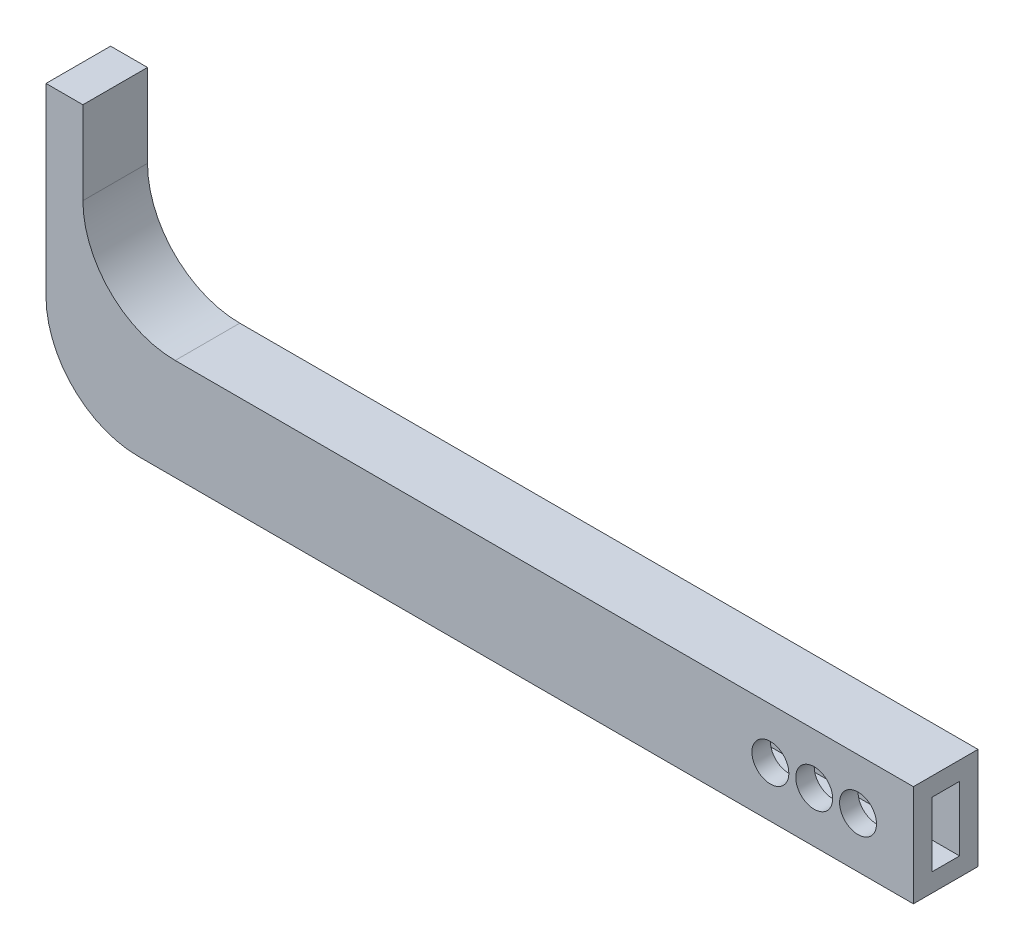
ISO-10303-21;
HEADER;
FILE_DESCRIPTION(('STEP AP214'),'2;1');
FILE_NAME('part.step','',(''),(''),'','','');
FILE_SCHEMA(('AUTOMOTIVE_DESIGN { 1 0 10303 214 1 1 1 1 }'));
ENDSEC;
DATA;
#1=APPLICATION_CONTEXT('core data for automotive mechanical design processes');
#2=APPLICATION_PROTOCOL_DEFINITION('international standard','automotive_design',2000,#1);
#3=PRODUCT_CONTEXT('',#1,'mechanical');
#4=PRODUCT('Part','Part','',(#3));
#5=PRODUCT_RELATED_PRODUCT_CATEGORY('part','',(#4));
#6=PRODUCT_DEFINITION_FORMATION('','',#4);
#7=PRODUCT_DEFINITION_CONTEXT('part definition',#1,'design');
#8=PRODUCT_DEFINITION('design','',#6,#7);
#9=PRODUCT_DEFINITION_SHAPE('','',#8);
#10=(LENGTH_UNIT() NAMED_UNIT(*) SI_UNIT(.MILLI.,.METRE.));
#11=(NAMED_UNIT(*) PLANE_ANGLE_UNIT() SI_UNIT($,.RADIAN.));
#12=(NAMED_UNIT(*) SI_UNIT($,.STERADIAN.) SOLID_ANGLE_UNIT());
#13=UNCERTAINTY_MEASURE_WITH_UNIT(LENGTH_MEASURE(1.E-05),#10,'distance_accuracy_value','');
#14=(GEOMETRIC_REPRESENTATION_CONTEXT(3) GLOBAL_UNCERTAINTY_ASSIGNED_CONTEXT((#13)) GLOBAL_UNIT_ASSIGNED_CONTEXT((#10,
#11,#12)) REPRESENTATION_CONTEXT('',''));
#15=CARTESIAN_POINT('',(0.,0.,0.));
#16=DIRECTION('',(0.,0.,1.));
#17=DIRECTION('',(1.,0.,0.));
#18=AXIS2_PLACEMENT_3D('',#15,#16,#17);
#19=CARTESIAN_POINT('',(0.,5.5,3.5));
#20=DIRECTION('',(-1.,0.,0.));
#21=DIRECTION('',(0.,-1.,0.));
#22=AXIS2_PLACEMENT_3D('',#19,#20,#21);
#23=PLANE('',#22);
#24=DIRECTION('',(0.,1.,0.));
#25=VECTOR('',#24,1.);
#26=CARTESIAN_POINT('',(0.,5.5,0.));
#27=LINE('',#26,#25);
#28=CARTESIAN_POINT('',(0.,0.,0.));
#29=VERTEX_POINT('',#28);
#30=CARTESIAN_POINT('',(0.,5.5,0.));
#31=VERTEX_POINT('',#30);
#32=EDGE_CURVE('E160',#29,#31,#27,.T.);
#33=ORIENTED_EDGE('',*,*,#32,.T.);
#34=DIRECTION('',(0.,0.,-1.));
#35=VECTOR('',#34,1.);
#36=CARTESIAN_POINT('',(0.,5.5,3.5));
#37=LINE('',#36,#35);
#38=CARTESIAN_POINT('',(0.,5.5,3.5));
#39=VERTEX_POINT('',#38);
#40=EDGE_CURVE('E227',#39,#31,#37,.T.);
#41=ORIENTED_EDGE('',*,*,#40,.F.);
#42=DIRECTION('',(0.,1.,0.));
#43=VECTOR('',#42,1.);
#44=CARTESIAN_POINT('',(0.,5.5,3.5));
#45=LINE('',#44,#43);
#46=CARTESIAN_POINT('',(0.,0.,3.5));
#47=VERTEX_POINT('',#46);
#48=EDGE_CURVE('E194',#47,#39,#45,.T.);
#49=ORIENTED_EDGE('',*,*,#48,.F.);
#50=DIRECTION('',(0.,0.,-1.));
#51=VECTOR('',#50,1.);
#52=CARTESIAN_POINT('',(0.,0.,3.5));
#53=LINE('',#52,#51);
#54=EDGE_CURVE('E208',#47,#29,#53,.T.);
#55=ORIENTED_EDGE('',*,*,#54,.T.);
#56=EDGE_LOOP('',(#33,#41,#49,#55));
#57=FACE_BOUND('',#56,.T.);
#58=DIRECTION('',(0.,1.,0.));
#59=VECTOR('',#58,1.);
#60=CARTESIAN_POINT('',(0.,0.,1.));
#61=LINE('',#60,#59);
#62=CARTESIAN_POINT('',(0.,1.,1.));
#63=VERTEX_POINT('',#62);
#64=CARTESIAN_POINT('',(0.,4.5,1.));
#65=VERTEX_POINT('',#64);
#66=EDGE_CURVE('E190',#63,#65,#61,.T.);
#67=ORIENTED_EDGE('',*,*,#66,.F.);
#68=DIRECTION('',(0.,0.,-1.));
#69=VECTOR('',#68,1.);
#70=CARTESIAN_POINT('',(0.,1.,3.5));
#71=LINE('',#70,#69);
#72=CARTESIAN_POINT('',(0.,1.,2.5));
#73=VERTEX_POINT('',#72);
#74=EDGE_CURVE('E186',#73,#63,#71,.T.);
#75=ORIENTED_EDGE('',*,*,#74,.F.);
#76=DIRECTION('',(0.,1.,0.));
#77=VECTOR('',#76,1.);
#78=CARTESIAN_POINT('',(0.,0.,2.5));
#79=LINE('',#78,#77);
#80=CARTESIAN_POINT('',(0.,4.5,2.5));
#81=VERTEX_POINT('',#80);
#82=EDGE_CURVE('E50',#73,#81,#79,.T.);
#83=ORIENTED_EDGE('',*,*,#82,.T.);
#84=DIRECTION('',(0.,0.,-1.));
#85=VECTOR('',#84,1.);
#86=CARTESIAN_POINT('',(0.,4.5,3.5));
#87=LINE('',#86,#85);
#88=EDGE_CURVE('E154',#81,#65,#87,.T.);
#89=ORIENTED_EDGE('',*,*,#88,.T.);
#90=EDGE_LOOP('',(#67,#75,#83,#89));
#91=FACE_BOUND('',#90,.T.);
#92=ADVANCED_FACE('F33',(#57,#91),#23,.F.);
#93=CARTESIAN_POINT('',(-45.,5.5,3.5));
#94=DIRECTION('',(0.,-1.,0.));
#95=DIRECTION('',(0.,0.,-1.));
#96=AXIS2_PLACEMENT_3D('',#93,#94,#95);
#97=PLANE('',#96);
#98=DIRECTION('',(-1.,0.,0.));
#99=VECTOR('',#98,1.);
#100=CARTESIAN_POINT('',(-45.,5.5,0.));
#101=LINE('',#100,#99);
#102=CARTESIAN_POINT('',(-40.,5.5,0.));
#103=VERTEX_POINT('',#102);
#104=EDGE_CURVE('E163',#31,#103,#101,.T.);
#105=ORIENTED_EDGE('',*,*,#104,.T.);
#106=DIRECTION('',(0.,0.,-1.));
#107=VECTOR('',#106,1.);
#108=CARTESIAN_POINT('',(-40.,5.5,3.5));
#109=LINE('',#108,#107);
#110=CARTESIAN_POINT('',(-40.,5.5,3.5));
#111=VERTEX_POINT('',#110);
#112=EDGE_CURVE('E233',#103,#111,#109,.F.);
#113=ORIENTED_EDGE('',*,*,#112,.T.);
#114=DIRECTION('',(-1.,0.,0.));
#115=VECTOR('',#114,1.);
#116=CARTESIAN_POINT('',(-45.,5.5,3.5));
#117=LINE('',#116,#115);
#118=EDGE_CURVE('E197',#39,#111,#117,.T.);
#119=ORIENTED_EDGE('',*,*,#118,.F.);
#120=ORIENTED_EDGE('',*,*,#40,.T.);
#121=EDGE_LOOP('',(#105,#113,#119,#120));
#122=FACE_BOUND('',#121,.T.);
#123=ADVANCED_FACE('F296',(#122),#97,.F.);
#124=CARTESIAN_POINT('',(-45.,15.,3.5));
#125=DIRECTION('',(-1.,0.,0.));
#126=DIRECTION('',(0.,0.,1.));
#127=AXIS2_PLACEMENT_3D('',#124,#125,#126);
#128=PLANE('',#127);
#129=DIRECTION('',(0.,1.,0.));
#130=VECTOR('',#129,1.);
#131=CARTESIAN_POINT('',(-45.,15.,3.5));
#132=LINE('',#131,#130);
#133=CARTESIAN_POINT('',(-45.,10.5,3.5));
#134=VERTEX_POINT('',#133);
#135=CARTESIAN_POINT('',(-45.,15.,3.5));
#136=VERTEX_POINT('',#135);
#137=EDGE_CURVE('E201',#134,#136,#132,.T.);
#138=ORIENTED_EDGE('',*,*,#137,.F.);
#139=DIRECTION('',(0.,0.,-1.));
#140=VECTOR('',#139,1.);
#141=CARTESIAN_POINT('',(-45.,10.5,0.));
#142=LINE('',#141,#140);
#143=CARTESIAN_POINT('',(-45.,10.5,0.));
#144=VERTEX_POINT('',#143);
#145=EDGE_CURVE('E230',#134,#144,#142,.T.);
#146=ORIENTED_EDGE('',*,*,#145,.T.);
#147=DIRECTION('',(0.,1.,0.));
#148=VECTOR('',#147,1.);
#149=CARTESIAN_POINT('',(-45.,15.,0.));
#150=LINE('',#149,#148);
#151=CARTESIAN_POINT('',(-45.,15.,0.));
#152=VERTEX_POINT('',#151);
#153=EDGE_CURVE('E212',#144,#152,#150,.T.);
#154=ORIENTED_EDGE('',*,*,#153,.T.);
#155=DIRECTION('',(0.,0.,-1.));
#156=VECTOR('',#155,1.);
#157=CARTESIAN_POINT('',(-45.,15.,3.5));
#158=LINE('',#157,#156);
#159=EDGE_CURVE('E224',#136,#152,#158,.T.);
#160=ORIENTED_EDGE('',*,*,#159,.F.);
#161=EDGE_LOOP('',(#138,#146,#154,#160));
#162=FACE_BOUND('',#161,.T.);
#163=ADVANCED_FACE('F302',(#162),#128,.F.);
#164=CARTESIAN_POINT('',(-47.,15.,3.5));
#165=DIRECTION('',(0.,-1.,0.));
#166=DIRECTION('',(0.,0.,-1.));
#167=AXIS2_PLACEMENT_3D('',#164,#165,#166);
#168=PLANE('',#167);
#169=DIRECTION('',(-1.,0.,0.));
#170=VECTOR('',#169,1.);
#171=CARTESIAN_POINT('',(-47.,15.,0.));
#172=LINE('',#171,#170);
#173=CARTESIAN_POINT('',(-47.,15.,0.));
#174=VERTEX_POINT('',#173);
#175=EDGE_CURVE('E214',#152,#174,#172,.T.);
#176=ORIENTED_EDGE('',*,*,#175,.T.);
#177=DIRECTION('',(0.,0.,-1.));
#178=VECTOR('',#177,1.);
#179=CARTESIAN_POINT('',(-47.,15.,3.5));
#180=LINE('',#179,#178);
#181=CARTESIAN_POINT('',(-47.,15.,3.5));
#182=VERTEX_POINT('',#181);
#183=EDGE_CURVE('E221',#182,#174,#180,.T.);
#184=ORIENTED_EDGE('',*,*,#183,.F.);
#185=DIRECTION('',(-1.,0.,0.));
#186=VECTOR('',#185,1.);
#187=CARTESIAN_POINT('',(-47.,15.,3.5));
#188=LINE('',#187,#186);
#189=EDGE_CURVE('E203',#136,#182,#188,.T.);
#190=ORIENTED_EDGE('',*,*,#189,.F.);
#191=ORIENTED_EDGE('',*,*,#159,.T.);
#192=EDGE_LOOP('',(#176,#184,#190,#191));
#193=FACE_BOUND('',#192,.T.);
#194=ADVANCED_FACE('F331',(#193),#168,.F.);
#195=CARTESIAN_POINT('',(-47.,0.,3.5));
#196=DIRECTION('',(1.,0.,0.));
#197=DIRECTION('',(0.,0.,-1.));
#198=AXIS2_PLACEMENT_3D('',#195,#196,#197);
#199=PLANE('',#198);
#200=DIRECTION('',(0.,-1.,0.));
#201=VECTOR('',#200,1.);
#202=CARTESIAN_POINT('',(-47.,0.,0.));
#203=LINE('',#202,#201);
#204=CARTESIAN_POINT('',(-47.,4.99999999999999,0.));
#205=VERTEX_POINT('',#204);
#206=EDGE_CURVE('E216',#174,#205,#203,.T.);
#207=ORIENTED_EDGE('',*,*,#206,.T.);
#208=DIRECTION('',(0.,0.,-1.));
#209=VECTOR('',#208,1.);
#210=CARTESIAN_POINT('',(-47.,4.99999999999999,3.5));
#211=LINE('',#210,#209);
#212=CARTESIAN_POINT('',(-47.,4.99999999999999,3.5));
#213=VERTEX_POINT('',#212);
#214=EDGE_CURVE('E58',#205,#213,#211,.F.);
#215=ORIENTED_EDGE('',*,*,#214,.T.);
#216=DIRECTION('',(0.,-1.,0.));
#217=VECTOR('',#216,1.);
#218=CARTESIAN_POINT('',(-47.,0.,3.5));
#219=LINE('',#218,#217);
#220=EDGE_CURVE('E205',#182,#213,#219,.T.);
#221=ORIENTED_EDGE('',*,*,#220,.F.);
#222=ORIENTED_EDGE('',*,*,#183,.T.);
#223=EDGE_LOOP('',(#207,#215,#221,#222));
#224=FACE_BOUND('',#223,.T.);
#225=ADVANCED_FACE('F344',(#224),#199,.F.);
#226=CARTESIAN_POINT('',(0.,0.,3.5));
#227=DIRECTION('',(0.,1.,0.));
#228=DIRECTION('',(-1.,0.,0.));
#229=AXIS2_PLACEMENT_3D('',#226,#227,#228);
#230=PLANE('',#229);
#231=DIRECTION('',(1.,0.,0.));
#232=VECTOR('',#231,1.);
#233=CARTESIAN_POINT('',(0.,0.,3.5));
#234=LINE('',#233,#232);
#235=CARTESIAN_POINT('',(-42.,0.,3.5));
#236=VERTEX_POINT('',#235);
#237=EDGE_CURVE('E207',#236,#47,#234,.T.);
#238=ORIENTED_EDGE('',*,*,#237,.F.);
#239=DIRECTION('',(0.,0.,-1.));
#240=VECTOR('',#239,1.);
#241=CARTESIAN_POINT('',(-42.,0.,3.5));
#242=LINE('',#241,#240);
#243=CARTESIAN_POINT('',(-42.,0.,0.));
#244=VERTEX_POINT('',#243);
#245=EDGE_CURVE('E235',#236,#244,#242,.T.);
#246=ORIENTED_EDGE('',*,*,#245,.T.);
#247=DIRECTION('',(1.,0.,0.));
#248=VECTOR('',#247,1.);
#249=CARTESIAN_POINT('',(0.,0.,0.));
#250=LINE('',#249,#248);
#251=EDGE_CURVE('E198',#244,#29,#250,.T.);
#252=ORIENTED_EDGE('',*,*,#251,.T.);
#253=ORIENTED_EDGE('',*,*,#54,.F.);
#254=EDGE_LOOP('',(#238,#246,#252,#253));
#255=FACE_BOUND('',#254,.T.);
#256=ADVANCED_FACE('F337',(#255),#230,.F.);
#257=CARTESIAN_POINT('',(0.,0.,3.5));
#258=DIRECTION('',(0.,0.,-1.));
#259=DIRECTION('',(-1.,0.,0.));
#260=AXIS2_PLACEMENT_3D('',#257,#258,#259);
#261=PLANE('',#260);
#262=CARTESIAN_POINT('',(-7.75,2.75,3.5));
#263=DIRECTION('',(0.,0.,1.));
#264=DIRECTION('',(1.,0.,0.));
#265=AXIS2_PLACEMENT_3D('',#262,#263,#264);
#266=CIRCLE('',#265,1.);
#267=CARTESIAN_POINT('',(-6.75,2.75,3.5));
#268=VERTEX_POINT('',#267);
#269=EDGE_CURVE('E518',#268,#268,#266,.T.);
#270=ORIENTED_EDGE('',*,*,#269,.F.);
#271=EDGE_LOOP('',(#270));
#272=FACE_BOUND('',#271,.T.);
#273=CARTESIAN_POINT('',(-5.375,2.75,3.5));
#274=DIRECTION('',(0.,0.,1.));
#275=DIRECTION('',(1.,0.,0.));
#276=AXIS2_PLACEMENT_3D('',#273,#274,#275);
#277=CIRCLE('',#276,1.);
#278=CARTESIAN_POINT('',(-4.375,2.75,3.5));
#279=VERTEX_POINT('',#278);
#280=EDGE_CURVE('E257',#279,#279,#277,.T.);
#281=ORIENTED_EDGE('',*,*,#280,.F.);
#282=EDGE_LOOP('',(#281));
#283=FACE_BOUND('',#282,.T.);
#284=CARTESIAN_POINT('',(-3.,2.75,3.5));
#285=DIRECTION('',(0.,0.,1.));
#286=DIRECTION('',(1.,0.,0.));
#287=AXIS2_PLACEMENT_3D('',#284,#285,#286);
#288=CIRCLE('',#287,1.);
#289=CARTESIAN_POINT('',(-2.,2.75,3.5));
#290=VERTEX_POINT('',#289);
#291=EDGE_CURVE('E254',#290,#290,#288,.T.);
#292=ORIENTED_EDGE('',*,*,#291,.F.);
#293=EDGE_LOOP('',(#292));
#294=FACE_BOUND('',#293,.T.);
#295=ORIENTED_EDGE('',*,*,#220,.T.);
#296=CARTESIAN_POINT('',(-42.,4.99999999999999,3.5));
#297=DIRECTION('',(0.,0.,-1.));
#298=DIRECTION('',(-1.,0.,0.));
#299=AXIS2_PLACEMENT_3D('',#296,#297,#298);
#300=CIRCLE('',#299,5.);
#301=EDGE_CURVE('E241',#213,#236,#300,.F.);
#302=ORIENTED_EDGE('',*,*,#301,.T.);
#303=ORIENTED_EDGE('',*,*,#237,.T.);
#304=ORIENTED_EDGE('',*,*,#48,.T.);
#305=ORIENTED_EDGE('',*,*,#118,.T.);
#306=CARTESIAN_POINT('',(-40.,10.5,3.5));
#307=DIRECTION('',(0.,0.,-1.));
#308=DIRECTION('',(-1.,0.,0.));
#309=AXIS2_PLACEMENT_3D('',#306,#307,#308);
#310=CIRCLE('',#309,5.);
#311=EDGE_CURVE('E11',#111,#134,#310,.T.);
#312=ORIENTED_EDGE('',*,*,#311,.T.);
#313=ORIENTED_EDGE('',*,*,#137,.T.);
#314=ORIENTED_EDGE('',*,*,#189,.T.);
#315=EDGE_LOOP('',(#295,#302,#303,#304,#305,#312,#313,#314));
#316=FACE_BOUND('',#315,.T.);
#317=ADVANCED_FACE('F316',(#272,#283,#294,#316),#261,.F.);
#318=CARTESIAN_POINT('',(0.,0.,0.));
#319=DIRECTION('',(0.,0.,-1.));
#320=DIRECTION('',(-1.,0.,0.));
#321=AXIS2_PLACEMENT_3D('',#318,#319,#320);
#322=PLANE('',#321);
#323=CARTESIAN_POINT('',(-7.75,2.75,0.));
#324=DIRECTION('',(0.,0.,-1.));
#325=DIRECTION('',(-1.,0.,0.));
#326=AXIS2_PLACEMENT_3D('',#323,#324,#325);
#327=CIRCLE('',#326,1.);
#328=CARTESIAN_POINT('',(-8.75,2.75,0.));
#329=VERTEX_POINT('',#328);
#330=EDGE_CURVE('E519',#329,#329,#327,.F.);
#331=ORIENTED_EDGE('',*,*,#330,.T.);
#332=EDGE_LOOP('',(#331));
#333=FACE_BOUND('',#332,.T.);
#334=CARTESIAN_POINT('',(-5.375,2.75,0.));
#335=DIRECTION('',(0.,0.,-1.));
#336=DIRECTION('',(-1.,0.,0.));
#337=AXIS2_PLACEMENT_3D('',#334,#335,#336);
#338=CIRCLE('',#337,1.);
#339=CARTESIAN_POINT('',(-6.375,2.75,0.));
#340=VERTEX_POINT('',#339);
#341=EDGE_CURVE('E250',#340,#340,#338,.F.);
#342=ORIENTED_EDGE('',*,*,#341,.T.);
#343=EDGE_LOOP('',(#342));
#344=FACE_BOUND('',#343,.T.);
#345=CARTESIAN_POINT('',(-3.,2.75,0.));
#346=DIRECTION('',(0.,0.,-1.));
#347=DIRECTION('',(-1.,0.,0.));
#348=AXIS2_PLACEMENT_3D('',#345,#346,#347);
#349=CIRCLE('',#348,1.);
#350=CARTESIAN_POINT('',(-4.,2.75,0.));
#351=VERTEX_POINT('',#350);
#352=EDGE_CURVE('E246',#351,#351,#349,.F.);
#353=ORIENTED_EDGE('',*,*,#352,.T.);
#354=EDGE_LOOP('',(#353));
#355=FACE_BOUND('',#354,.T.);
#356=ORIENTED_EDGE('',*,*,#251,.F.);
#357=CARTESIAN_POINT('',(-42.,4.99999999999999,0.));
#358=DIRECTION('',(0.,0.,-1.));
#359=DIRECTION('',(-1.,0.,0.));
#360=AXIS2_PLACEMENT_3D('',#357,#358,#359);
#361=CIRCLE('',#360,5.);
#362=EDGE_CURVE('E238',#244,#205,#361,.T.);
#363=ORIENTED_EDGE('',*,*,#362,.T.);
#364=ORIENTED_EDGE('',*,*,#206,.F.);
#365=ORIENTED_EDGE('',*,*,#175,.F.);
#366=ORIENTED_EDGE('',*,*,#153,.F.);
#367=CARTESIAN_POINT('',(-40.,10.5,0.));
#368=DIRECTION('',(0.,0.,-1.));
#369=DIRECTION('',(-1.,0.,0.));
#370=AXIS2_PLACEMENT_3D('',#367,#368,#369);
#371=CIRCLE('',#370,5.);
#372=EDGE_CURVE('E42',#144,#103,#371,.F.);
#373=ORIENTED_EDGE('',*,*,#372,.T.);
#374=ORIENTED_EDGE('',*,*,#104,.F.);
#375=ORIENTED_EDGE('',*,*,#32,.F.);
#376=EDGE_LOOP('',(#356,#363,#364,#365,#366,#373,#374,#375));
#377=FACE_BOUND('',#376,.T.);
#378=ADVANCED_FACE('F309',(#333,#344,#355,#377),#322,.T.);
#379=CARTESIAN_POINT('',(-40.,10.5,3.5));
#380=DIRECTION('',(0.,0.,1.));
#381=DIRECTION('',(1.,0.,0.));
#382=AXIS2_PLACEMENT_3D('',#379,#380,#381);
#383=CYLINDRICAL_SURFACE('',#382,5.);
#384=ORIENTED_EDGE('',*,*,#311,.F.);
#385=ORIENTED_EDGE('',*,*,#112,.F.);
#386=ORIENTED_EDGE('',*,*,#372,.F.);
#387=ORIENTED_EDGE('',*,*,#145,.F.);
#388=EDGE_LOOP('',(#384,#385,#386,#387));
#389=FACE_BOUND('',#388,.T.);
#390=ADVANCED_FACE('F307',(#389),#383,.F.);
#391=CARTESIAN_POINT('',(-42.,4.99999999999999,3.5));
#392=DIRECTION('',(0.,0.,-1.));
#393=DIRECTION('',(-1.,0.,0.));
#394=AXIS2_PLACEMENT_3D('',#391,#392,#393);
#395=CYLINDRICAL_SURFACE('',#394,5.);
#396=ORIENTED_EDGE('',*,*,#301,.F.);
#397=ORIENTED_EDGE('',*,*,#214,.F.);
#398=ORIENTED_EDGE('',*,*,#362,.F.);
#399=ORIENTED_EDGE('',*,*,#245,.F.);
#400=EDGE_LOOP('',(#396,#397,#398,#399));
#401=FACE_BOUND('',#400,.T.);
#402=ADVANCED_FACE('F35',(#401),#395,.T.);
#403=CARTESIAN_POINT('',(-45.,4.5,3.5));
#404=DIRECTION('',(0.,-1.,0.));
#405=DIRECTION('',(0.,0.,-1.));
#406=AXIS2_PLACEMENT_3D('',#403,#404,#405);
#407=PLANE('',#406);
#408=DIRECTION('',(-1.,0.,0.));
#409=VECTOR('',#408,1.);
#410=CARTESIAN_POINT('',(0.,4.5,1.));
#411=LINE('',#410,#409);
#412=CARTESIAN_POINT('',(-40.,4.5,1.));
#413=VERTEX_POINT('',#412);
#414=EDGE_CURVE('E176',#65,#413,#411,.T.);
#415=ORIENTED_EDGE('',*,*,#414,.F.);
#416=ORIENTED_EDGE('',*,*,#88,.F.);
#417=DIRECTION('',(-1.,0.,0.));
#418=VECTOR('',#417,1.);
#419=CARTESIAN_POINT('',(0.,4.5,2.5));
#420=LINE('',#419,#418);
#421=CARTESIAN_POINT('',(-40.,4.5,2.5));
#422=VERTEX_POINT('',#421);
#423=EDGE_CURVE('E151',#81,#422,#420,.T.);
#424=ORIENTED_EDGE('',*,*,#423,.T.);
#425=DIRECTION('',(0.,0.,-1.));
#426=VECTOR('',#425,1.);
#427=CARTESIAN_POINT('',(-40.,4.5,3.5));
#428=LINE('',#427,#426);
#429=EDGE_CURVE('E138',#413,#422,#428,.F.);
#430=ORIENTED_EDGE('',*,*,#429,.F.);
#431=EDGE_LOOP('',(#415,#416,#424,#430));
#432=FACE_BOUND('',#431,.T.);
#433=ADVANCED_FACE('F152',(#432),#407,.T.);
#434=CARTESIAN_POINT('',(-46.,0.,3.5));
#435=DIRECTION('',(1.,0.,0.));
#436=DIRECTION('',(0.,0.,-1.));
#437=AXIS2_PLACEMENT_3D('',#434,#435,#436);
#438=PLANE('',#437);
#439=DIRECTION('',(0.,-1.,0.));
#440=VECTOR('',#439,1.);
#441=CARTESIAN_POINT('',(-46.,0.,2.5));
#442=LINE('',#441,#440);
#443=CARTESIAN_POINT('',(-46.,10.5,2.5));
#444=VERTEX_POINT('',#443);
#445=CARTESIAN_POINT('',(-46.,4.99999999999999,2.5));
#446=VERTEX_POINT('',#445);
#447=EDGE_CURVE('E155',#444,#446,#442,.T.);
#448=ORIENTED_EDGE('',*,*,#447,.T.);
#449=DIRECTION('',(0.,0.,-1.));
#450=VECTOR('',#449,1.);
#451=CARTESIAN_POINT('',(-46.,4.99999999999999,3.5));
#452=LINE('',#451,#450);
#453=CARTESIAN_POINT('',(-46.,4.99999999999999,1.));
#454=VERTEX_POINT('',#453);
#455=EDGE_CURVE('E177',#454,#446,#452,.F.);
#456=ORIENTED_EDGE('',*,*,#455,.F.);
#457=DIRECTION('',(0.,-1.,0.));
#458=VECTOR('',#457,1.);
#459=CARTESIAN_POINT('',(-46.,0.,1.));
#460=LINE('',#459,#458);
#461=CARTESIAN_POINT('',(-46.,10.5,1.));
#462=VERTEX_POINT('',#461);
#463=EDGE_CURVE('E172',#462,#454,#460,.T.);
#464=ORIENTED_EDGE('',*,*,#463,.F.);
#465=DIRECTION('',(0.,0.,1.));
#466=VECTOR('',#465,1.);
#467=CARTESIAN_POINT('',(-46.,10.5,3.5));
#468=LINE('',#467,#466);
#469=EDGE_CURVE('E148',#444,#462,#468,.F.);
#470=ORIENTED_EDGE('',*,*,#469,.F.);
#471=EDGE_LOOP('',(#448,#456,#464,#470));
#472=FACE_BOUND('',#471,.T.);
#473=ADVANCED_FACE('F286',(#472),#438,.T.);
#474=CARTESIAN_POINT('',(0.,1.,3.5));
#475=DIRECTION('',(0.,1.,0.));
#476=DIRECTION('',(-1.,0.,0.));
#477=AXIS2_PLACEMENT_3D('',#474,#475,#476);
#478=PLANE('',#477);
#479=DIRECTION('',(1.,0.,0.));
#480=VECTOR('',#479,1.);
#481=CARTESIAN_POINT('',(0.,1.,2.5));
#482=LINE('',#481,#480);
#483=CARTESIAN_POINT('',(-42.,0.999999999999995,2.5));
#484=VERTEX_POINT('',#483);
#485=EDGE_CURVE('E169',#484,#73,#482,.T.);
#486=ORIENTED_EDGE('',*,*,#485,.T.);
#487=ORIENTED_EDGE('',*,*,#74,.T.);
#488=DIRECTION('',(1.,0.,0.));
#489=VECTOR('',#488,1.);
#490=CARTESIAN_POINT('',(0.,1.,1.));
#491=LINE('',#490,#489);
#492=CARTESIAN_POINT('',(-42.,0.999999999999995,1.));
#493=VERTEX_POINT('',#492);
#494=EDGE_CURVE('E175',#493,#63,#491,.T.);
#495=ORIENTED_EDGE('',*,*,#494,.F.);
#496=DIRECTION('',(0.,0.,1.));
#497=VECTOR('',#496,1.);
#498=CARTESIAN_POINT('',(-42.,0.999999999999995,3.5));
#499=LINE('',#498,#497);
#500=EDGE_CURVE('E147',#484,#493,#499,.F.);
#501=ORIENTED_EDGE('',*,*,#500,.F.);
#502=EDGE_LOOP('',(#486,#487,#495,#501));
#503=FACE_BOUND('',#502,.T.);
#504=ADVANCED_FACE('F280',(#503),#478,.T.);
#505=CARTESIAN_POINT('',(0.,0.,2.5));
#506=DIRECTION('',(0.,0.,-1.));
#507=DIRECTION('',(-1.,0.,0.));
#508=AXIS2_PLACEMENT_3D('',#505,#506,#507);
#509=PLANE('',#508);
#510=CARTESIAN_POINT('',(-7.75,2.75,2.5));
#511=DIRECTION('',(0.,0.,-1.));
#512=DIRECTION('',(-1.,0.,0.));
#513=AXIS2_PLACEMENT_3D('',#510,#511,#512);
#514=CIRCLE('',#513,1.);
#515=CARTESIAN_POINT('',(-8.75,2.75,2.5));
#516=VERTEX_POINT('',#515);
#517=EDGE_CURVE('E262',#516,#516,#514,.T.);
#518=ORIENTED_EDGE('',*,*,#517,.F.);
#519=EDGE_LOOP('',(#518));
#520=FACE_BOUND('',#519,.T.);
#521=CARTESIAN_POINT('',(-5.375,2.75,2.5));
#522=DIRECTION('',(0.,0.,-1.));
#523=DIRECTION('',(-1.,0.,0.));
#524=AXIS2_PLACEMENT_3D('',#521,#522,#523);
#525=CIRCLE('',#524,1.);
#526=CARTESIAN_POINT('',(-6.375,2.75,2.5));
#527=VERTEX_POINT('',#526);
#528=EDGE_CURVE('E249',#527,#527,#525,.T.);
#529=ORIENTED_EDGE('',*,*,#528,.F.);
#530=EDGE_LOOP('',(#529));
#531=FACE_BOUND('',#530,.T.);
#532=CARTESIAN_POINT('',(-3.,2.75,2.5));
#533=DIRECTION('',(0.,0.,-1.));
#534=DIRECTION('',(-1.,0.,0.));
#535=AXIS2_PLACEMENT_3D('',#532,#533,#534);
#536=CIRCLE('',#535,1.);
#537=CARTESIAN_POINT('',(-4.,2.75,2.5));
#538=VERTEX_POINT('',#537);
#539=EDGE_CURVE('E193',#538,#538,#536,.T.);
#540=ORIENTED_EDGE('',*,*,#539,.F.);
#541=EDGE_LOOP('',(#540));
#542=FACE_BOUND('',#541,.T.);
#543=CARTESIAN_POINT('',(-40.,10.5,2.5));
#544=DIRECTION('',(0.,0.,-1.));
#545=DIRECTION('',(-1.,0.,0.));
#546=AXIS2_PLACEMENT_3D('',#543,#544,#545);
#547=CIRCLE('',#546,6.);
#548=EDGE_CURVE('E142',#422,#444,#547,.T.);
#549=ORIENTED_EDGE('',*,*,#548,.F.);
#550=ORIENTED_EDGE('',*,*,#423,.F.);
#551=ORIENTED_EDGE('',*,*,#82,.F.);
#552=ORIENTED_EDGE('',*,*,#485,.F.);
#553=CARTESIAN_POINT('',(-42.,4.99999999999999,2.5));
#554=DIRECTION('',(0.,0.,-1.));
#555=DIRECTION('',(-1.,0.,0.));
#556=AXIS2_PLACEMENT_3D('',#553,#554,#555);
#557=CIRCLE('',#556,4.);
#558=EDGE_CURVE('E165',#446,#484,#557,.F.);
#559=ORIENTED_EDGE('',*,*,#558,.F.);
#560=ORIENTED_EDGE('',*,*,#447,.F.);
#561=EDGE_LOOP('',(#549,#550,#551,#552,#559,#560));
#562=FACE_BOUND('',#561,.T.);
#563=ADVANCED_FACE('F158',(#520,#531,#542,#562),#509,.T.);
#564=CARTESIAN_POINT('',(0.,0.,1.));
#565=DIRECTION('',(0.,0.,-1.));
#566=DIRECTION('',(-1.,0.,0.));
#567=AXIS2_PLACEMENT_3D('',#564,#565,#566);
#568=PLANE('',#567);
#569=CARTESIAN_POINT('',(-7.75,2.75,1.));
#570=DIRECTION('',(0.,0.,-1.));
#571=DIRECTION('',(-1.,0.,0.));
#572=AXIS2_PLACEMENT_3D('',#569,#570,#571);
#573=CIRCLE('',#572,1.);
#574=CARTESIAN_POINT('',(-8.75,2.75,1.));
#575=VERTEX_POINT('',#574);
#576=EDGE_CURVE('E37',#575,#575,#573,.T.);
#577=ORIENTED_EDGE('',*,*,#576,.T.);
#578=EDGE_LOOP('',(#577));
#579=FACE_BOUND('',#578,.T.);
#580=CARTESIAN_POINT('',(-5.375,2.75,1.));
#581=DIRECTION('',(0.,0.,-1.));
#582=DIRECTION('',(-1.,0.,0.));
#583=AXIS2_PLACEMENT_3D('',#580,#581,#582);
#584=CIRCLE('',#583,1.);
#585=CARTESIAN_POINT('',(-6.375,2.75,1.));
#586=VERTEX_POINT('',#585);
#587=EDGE_CURVE('E247',#586,#586,#584,.T.);
#588=ORIENTED_EDGE('',*,*,#587,.T.);
#589=EDGE_LOOP('',(#588));
#590=FACE_BOUND('',#589,.T.);
#591=CARTESIAN_POINT('',(-3.,2.75,1.));
#592=DIRECTION('',(0.,0.,-1.));
#593=DIRECTION('',(-1.,0.,0.));
#594=AXIS2_PLACEMENT_3D('',#591,#592,#593);
#595=CIRCLE('',#594,1.);
#596=CARTESIAN_POINT('',(-4.,2.75,1.));
#597=VERTEX_POINT('',#596);
#598=EDGE_CURVE('E244',#597,#597,#595,.T.);
#599=ORIENTED_EDGE('',*,*,#598,.T.);
#600=EDGE_LOOP('',(#599));
#601=FACE_BOUND('',#600,.T.);
#602=ORIENTED_EDGE('',*,*,#494,.T.);
#603=ORIENTED_EDGE('',*,*,#66,.T.);
#604=ORIENTED_EDGE('',*,*,#414,.T.);
#605=CARTESIAN_POINT('',(-40.,10.5,1.));
#606=DIRECTION('',(0.,0.,-1.));
#607=DIRECTION('',(-1.,0.,0.));
#608=AXIS2_PLACEMENT_3D('',#605,#606,#607);
#609=CIRCLE('',#608,6.);
#610=EDGE_CURVE('E144',#462,#413,#609,.F.);
#611=ORIENTED_EDGE('',*,*,#610,.F.);
#612=ORIENTED_EDGE('',*,*,#463,.T.);
#613=CARTESIAN_POINT('',(-42.,4.99999999999999,1.));
#614=DIRECTION('',(0.,0.,-1.));
#615=DIRECTION('',(-1.,0.,0.));
#616=AXIS2_PLACEMENT_3D('',#613,#614,#615);
#617=CIRCLE('',#616,4.);
#618=EDGE_CURVE('E180',#493,#454,#617,.T.);
#619=ORIENTED_EDGE('',*,*,#618,.F.);
#620=EDGE_LOOP('',(#602,#603,#604,#611,#612,#619));
#621=FACE_BOUND('',#620,.T.);
#622=ADVANCED_FACE('F283',(#579,#590,#601,#621),#568,.F.);
#623=CARTESIAN_POINT('',(-40.,10.5,3.5));
#624=DIRECTION('',(0.,0.,1.));
#625=DIRECTION('',(1.,0.,0.));
#626=AXIS2_PLACEMENT_3D('',#623,#624,#625);
#627=CYLINDRICAL_SURFACE('',#626,6.);
#628=ORIENTED_EDGE('',*,*,#548,.T.);
#629=ORIENTED_EDGE('',*,*,#469,.T.);
#630=ORIENTED_EDGE('',*,*,#610,.T.);
#631=ORIENTED_EDGE('',*,*,#429,.T.);
#632=EDGE_LOOP('',(#628,#629,#630,#631));
#633=FACE_BOUND('',#632,.T.);
#634=ADVANCED_FACE('F140',(#633),#627,.T.);
#635=CARTESIAN_POINT('',(-42.,4.99999999999999,3.5));
#636=DIRECTION('',(0.,0.,-1.));
#637=DIRECTION('',(-1.,0.,0.));
#638=AXIS2_PLACEMENT_3D('',#635,#636,#637);
#639=CYLINDRICAL_SURFACE('',#638,4.);
#640=ORIENTED_EDGE('',*,*,#558,.T.);
#641=ORIENTED_EDGE('',*,*,#500,.T.);
#642=ORIENTED_EDGE('',*,*,#618,.T.);
#643=ORIENTED_EDGE('',*,*,#455,.T.);
#644=EDGE_LOOP('',(#640,#641,#642,#643));
#645=FACE_BOUND('',#644,.T.);
#646=ADVANCED_FACE('F274',(#645),#639,.F.);
#647=CARTESIAN_POINT('',(-3.,2.75,-2.82842712474619));
#648=DIRECTION('',(0.,0.,1.));
#649=DIRECTION('',(1.,0.,0.));
#650=AXIS2_PLACEMENT_3D('',#647,#648,#649);
#651=CYLINDRICAL_SURFACE('',#650,1.);
#652=ORIENTED_EDGE('',*,*,#352,.F.);
#653=EDGE_LOOP('',(#652));
#654=FACE_BOUND('',#653,.T.);
#655=ORIENTED_EDGE('',*,*,#598,.F.);
#656=EDGE_LOOP('',(#655));
#657=FACE_BOUND('',#656,.T.);
#658=ADVANCED_FACE('F451',(#654,#657),#651,.F.);
#659=ORIENTED_EDGE('',*,*,#539,.T.);
#660=EDGE_LOOP('',(#659));
#661=FACE_BOUND('',#660,.T.);
#662=ORIENTED_EDGE('',*,*,#291,.T.);
#663=EDGE_LOOP('',(#662));
#664=FACE_BOUND('',#663,.T.);
#665=ADVANCED_FACE('F458',(#661,#664),#651,.F.);
#666=CARTESIAN_POINT('',(-5.375,2.75,-2.82842712474619));
#667=DIRECTION('',(0.,0.,1.));
#668=DIRECTION('',(1.,0.,0.));
#669=AXIS2_PLACEMENT_3D('',#666,#667,#668);
#670=CYLINDRICAL_SURFACE('',#669,1.);
#671=ORIENTED_EDGE('',*,*,#341,.F.);
#672=EDGE_LOOP('',(#671));
#673=FACE_BOUND('',#672,.T.);
#674=ORIENTED_EDGE('',*,*,#587,.F.);
#675=EDGE_LOOP('',(#674));
#676=FACE_BOUND('',#675,.T.);
#677=ADVANCED_FACE('F467',(#673,#676),#670,.F.);
#678=ORIENTED_EDGE('',*,*,#528,.T.);
#679=EDGE_LOOP('',(#678));
#680=FACE_BOUND('',#679,.T.);
#681=ORIENTED_EDGE('',*,*,#280,.T.);
#682=EDGE_LOOP('',(#681));
#683=FACE_BOUND('',#682,.T.);
#684=ADVANCED_FACE('F475',(#680,#683),#670,.F.);
#685=CARTESIAN_POINT('',(-7.75,2.75,-2.82842712474619));
#686=DIRECTION('',(0.,0.,1.));
#687=DIRECTION('',(1.,0.,0.));
#688=AXIS2_PLACEMENT_3D('',#685,#686,#687);
#689=CYLINDRICAL_SURFACE('',#688,1.);
#690=ORIENTED_EDGE('',*,*,#330,.F.);
#691=EDGE_LOOP('',(#690));
#692=FACE_BOUND('',#691,.T.);
#693=ORIENTED_EDGE('',*,*,#576,.F.);
#694=EDGE_LOOP('',(#693));
#695=FACE_BOUND('',#694,.T.);
#696=ADVANCED_FACE('F484',(#692,#695),#689,.F.);
#697=ORIENTED_EDGE('',*,*,#517,.T.);
#698=EDGE_LOOP('',(#697));
#699=FACE_BOUND('',#698,.T.);
#700=ORIENTED_EDGE('',*,*,#269,.T.);
#701=EDGE_LOOP('',(#700));
#702=FACE_BOUND('',#701,.T.);
#703=ADVANCED_FACE('F492',(#699,#702),#689,.F.);
#704=CLOSED_SHELL('',(#92,#123,#163,#194,#225,#256,#317,#378,#390,#402,#433,#473,#504,#563,#622,
#634,#646,#658,#665,#677,#684,#696,#703));
#705=MANIFOLD_SOLID_BREP('B2',#704);
#706=ADVANCED_BREP_SHAPE_REPRESENTATION('',(#18,#705),#14);
#707=SHAPE_DEFINITION_REPRESENTATION(#9,#706);
ENDSEC;
END-ISO-10303-21;
